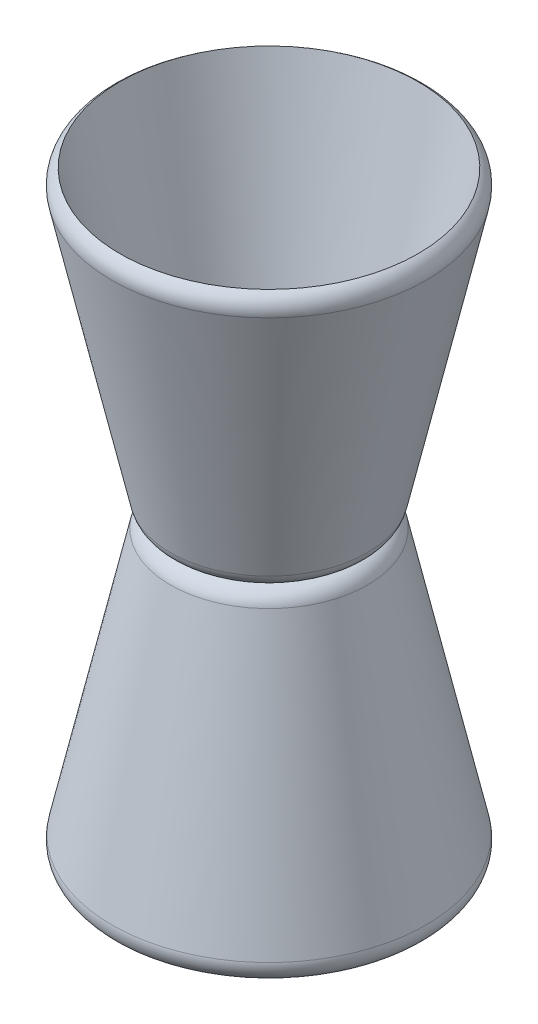
ISO-10303-21;
HEADER;
FILE_DESCRIPTION(('STEP AP214'),'2;1');
FILE_NAME('part.step','',(''),(''),'','','');
FILE_SCHEMA(('AUTOMOTIVE_DESIGN { 1 0 10303 214 1 1 1 1 }'));
ENDSEC;
DATA;
#1=APPLICATION_CONTEXT('core data for automotive mechanical design processes');
#2=APPLICATION_PROTOCOL_DEFINITION('international standard','automotive_design',2000,#1);
#3=PRODUCT_CONTEXT('',#1,'mechanical');
#4=PRODUCT('Part','Part','',(#3));
#5=PRODUCT_RELATED_PRODUCT_CATEGORY('part','',(#4));
#6=PRODUCT_DEFINITION_FORMATION('','',#4);
#7=PRODUCT_DEFINITION_CONTEXT('part definition',#1,'design');
#8=PRODUCT_DEFINITION('design','',#6,#7);
#9=PRODUCT_DEFINITION_SHAPE('','',#8);
#10=(LENGTH_UNIT() NAMED_UNIT(*) SI_UNIT(.MILLI.,.METRE.));
#11=(NAMED_UNIT(*) PLANE_ANGLE_UNIT() SI_UNIT($,.RADIAN.));
#12=(NAMED_UNIT(*) SI_UNIT($,.STERADIAN.) SOLID_ANGLE_UNIT());
#13=UNCERTAINTY_MEASURE_WITH_UNIT(LENGTH_MEASURE(1.E-05),#10,'distance_accuracy_value','');
#14=(GEOMETRIC_REPRESENTATION_CONTEXT(3) GLOBAL_UNCERTAINTY_ASSIGNED_CONTEXT((#13)) GLOBAL_UNIT_ASSIGNED_CONTEXT((#10,
#11,#12)) REPRESENTATION_CONTEXT('',''));
#15=CARTESIAN_POINT('',(0.,0.,0.));
#16=DIRECTION('',(0.,0.,1.));
#17=DIRECTION('',(1.,0.,0.));
#18=AXIS2_PLACEMENT_3D('',#15,#16,#17);
#19=CARTESIAN_POINT('',(0.,-330.841690925662,0.));
#20=DIRECTION('',(0.,-1.,0.));
#21=DIRECTION('',(1.,0.,0.));
#22=AXIS2_PLACEMENT_3D('',#19,#20,#21);
#23=PLANE('',#22);
#24=CARTESIAN_POINT('',(0.,-330.841690925662,0.));
#25=DIRECTION('',(0.,1.,0.));
#26=DIRECTION('',(-1.,0.,0.));
#27=AXIS2_PLACEMENT_3D('',#24,#25,#26);
#28=CIRCLE('',#27,150.565807481014);
#29=CARTESIAN_POINT('',(-150.565807481014,-330.841690925663,0.));
#30=VERTEX_POINT('',#29);
#31=EDGE_CURVE('E65',#30,#30,#28,.T.);
#32=ORIENTED_EDGE('',*,*,#31,.T.);
#33=EDGE_LOOP('',(#32));
#34=FACE_BOUND('',#33,.T.);
#35=ADVANCED_FACE('F37',(#34),#23,.F.);
#36=CARTESIAN_POINT('',(-1.37499654681077E-12,119.158309074338,0.));
#37=DIRECTION('',(0.,1.,0.));
#38=DIRECTION('',(-1.,0.,0.));
#39=AXIS2_PLACEMENT_3D('',#36,#37,#38);
#40=CONICAL_SURFACE('',#39,250.000000000001,0.217470446784428);
#41=ORIENTED_EDGE('',*,*,#31,.F.);
#42=EDGE_LOOP('',(#41));
#43=FACE_BOUND('',#42,.T.);
#44=CARTESIAN_POINT('',(-1.37499654681077E-12,119.158309074338,0.));
#45=DIRECTION('',(0.,1.,0.));
#46=DIRECTION('',(-1.,0.,0.));
#47=AXIS2_PLACEMENT_3D('',#44,#45,#46);
#48=CIRCLE('',#47,250.000000000001);
#49=CARTESIAN_POINT('',(-250.000000000003,119.158309074337,0.));
#50=VERTEX_POINT('',#49);
#51=EDGE_CURVE('E69',#50,#50,#48,.T.);
#52=ORIENTED_EDGE('',*,*,#51,.T.);
#53=EDGE_LOOP('',(#52));
#54=FACE_BOUND('',#53,.T.);
#55=ADVANCED_FACE('F100',(#43,#54),#40,.F.);
#56=CARTESIAN_POINT('',(1.4698612125882E-13,-380.841690925662,0.));
#57=DIRECTION('',(0.,1.,0.));
#58=DIRECTION('',(-1.,0.,0.));
#59=AXIS2_PLACEMENT_3D('',#56,#57,#58);
#60=CONICAL_SURFACE('',#59,160.,0.217470446784428);
#61=CARTESIAN_POINT('',(0.,-357.314501215556,0.));
#62=DIRECTION('',(0.,-1.,0.));
#63=DIRECTION('',(1.,0.,0.));
#64=AXIS2_PLACEMENT_3D('',#61,#62,#63);
#65=CIRCLE('',#64,165.198682469034);
#66=CARTESIAN_POINT('',(165.198682469034,-357.314501215556,0.));
#67=VERTEX_POINT('',#66);
#68=EDGE_CURVE('E55',#67,#67,#65,.F.);
#69=ORIENTED_EDGE('',*,*,#68,.T.);
#70=EDGE_LOOP('',(#69));
#71=FACE_BOUND('',#70,.T.);
#72=CARTESIAN_POINT('',(-1.27779274856509E-12,87.2250287929783,0.));
#73=DIRECTION('',(0.,-1.,0.));
#74=DIRECTION('',(1.,0.,0.));
#75=AXIS2_PLACEMENT_3D('',#72,#73,#74);
#76=CIRCLE('',#75,263.426302933854);
#77=CARTESIAN_POINT('',(263.426302933853,87.2250287929791,0.));
#78=VERTEX_POINT('',#77);
#79=EDGE_CURVE('E61',#78,#78,#76,.T.);
#80=ORIENTED_EDGE('',*,*,#79,.T.);
#81=EDGE_LOOP('',(#80));
#82=FACE_BOUND('',#81,.T.);
#83=ADVANCED_FACE('F106',(#71,#82),#60,.T.);
#84=CARTESIAN_POINT('',(0.,-350.841690925662,0.));
#85=DIRECTION('',(0.,1.,0.));
#86=DIRECTION('',(-1.,0.,0.));
#87=AXIS2_PLACEMENT_3D('',#84,#85,#86);
#88=TOROIDAL_SURFACE('',#87,135.905291969622,30.);
#89=CARTESIAN_POINT('',(1.46986121258819E-13,-380.841690925662,0.));
#90=DIRECTION('',(0.,1.,0.));
#91=DIRECTION('',(-1.,0.,0.));
#92=AXIS2_PLACEMENT_3D('',#89,#90,#91);
#93=CIRCLE('',#92,135.905291969622);
#94=CARTESIAN_POINT('',(-135.905291969622,-380.841690925662,0.));
#95=VERTEX_POINT('',#94);
#96=EDGE_CURVE('E50',#95,#95,#93,.F.);
#97=ORIENTED_EDGE('',*,*,#96,.F.);
#98=EDGE_LOOP('',(#97));
#99=FACE_BOUND('',#98,.T.);
#100=ORIENTED_EDGE('',*,*,#68,.F.);
#101=EDGE_LOOP('',(#100));
#102=FACE_BOUND('',#101,.T.);
#103=ADVANCED_FACE('F111',(#99,#102),#88,.T.);
#104=CARTESIAN_POINT('',(-1.29749575871494E-12,93.6978390828725,0.));
#105=DIRECTION('',(0.,1.,0.));
#106=DIRECTION('',(-1.,0.,0.));
#107=AXIS2_PLACEMENT_3D('',#104,#105,#106);
#108=TOROIDAL_SURFACE('',#107,234.132912434442,30.);
#109=ORIENTED_EDGE('',*,*,#79,.F.);
#110=EDGE_LOOP('',(#109));
#111=FACE_BOUND('',#110,.T.);
#112=ORIENTED_EDGE('',*,*,#51,.F.);
#113=EDGE_LOOP('',(#112));
#114=FACE_BOUND('',#113,.T.);
#115=ADVANCED_FACE('F96',(#111,#114),#108,.T.);
#116=CARTESIAN_POINT('',(2.99184388065778E-13,-430.841690925662,0.));
#117=DIRECTION('',(0.,1.,0.));
#118=DIRECTION('',(1.,0.,0.));
#119=AXIS2_PLACEMENT_3D('',#116,#117,#118);
#120=PLANE('',#119);
#121=CARTESIAN_POINT('',(2.99184388065777E-13,-430.841690925662,0.));
#122=DIRECTION('',(0.,1.,0.));
#123=DIRECTION('',(-1.,0.,0.));
#124=AXIS2_PLACEMENT_3D('',#121,#122,#123);
#125=CIRCLE('',#124,150.565807481014);
#126=CARTESIAN_POINT('',(-150.565807481014,-430.841690925662,0.));
#127=VERTEX_POINT('',#126);
#128=EDGE_CURVE('E73',#127,#127,#125,.T.);
#129=ORIENTED_EDGE('',*,*,#128,.F.);
#130=EDGE_LOOP('',(#129));
#131=FACE_BOUND('',#130,.T.);
#132=ADVANCED_FACE('F87',(#131),#120,.F.);
#133=CARTESIAN_POINT('',(1.66896878932841E-12,-880.841690925661,0.));
#134=DIRECTION('',(0.,-1.,0.));
#135=DIRECTION('',(-1.,0.,0.));
#136=AXIS2_PLACEMENT_3D('',#133,#134,#135);
#137=CONICAL_SURFACE('',#136,250.000000000001,0.217470446784428);
#138=ORIENTED_EDGE('',*,*,#128,.T.);
#139=EDGE_LOOP('',(#138));
#140=FACE_BOUND('',#139,.T.);
#141=CARTESIAN_POINT('',(1.66896878932841E-12,-880.841690925661,0.));
#142=DIRECTION('',(0.,1.,0.));
#143=DIRECTION('',(-1.,0.,0.));
#144=AXIS2_PLACEMENT_3D('',#141,#142,#143);
#145=CIRCLE('',#144,250.000000000001);
#146=CARTESIAN_POINT('',(-250.,-880.841690925662,0.));
#147=VERTEX_POINT('',#146);
#148=EDGE_CURVE('E77',#147,#147,#145,.T.);
#149=ORIENTED_EDGE('',*,*,#148,.F.);
#150=EDGE_LOOP('',(#149));
#151=FACE_BOUND('',#150,.T.);
#152=ADVANCED_FACE('F84',(#140,#151),#137,.F.);
#153=CARTESIAN_POINT('',(1.46986121258818E-13,-380.841690925662,0.));
#154=DIRECTION('',(0.,-1.,0.));
#155=DIRECTION('',(-1.,0.,0.));
#156=AXIS2_PLACEMENT_3D('',#153,#154,#155);
#157=CONICAL_SURFACE('',#156,160.,0.217470446784428);
#158=CARTESIAN_POINT('',(2.18602071193151E-13,-404.368880635768,0.));
#159=DIRECTION('',(0.,1.,0.));
#160=DIRECTION('',(-1.,0.,0.));
#161=AXIS2_PLACEMENT_3D('',#158,#159,#160);
#162=CIRCLE('',#161,165.198682469034);
#163=CARTESIAN_POINT('',(-165.198682469034,-404.368880635768,0.));
#164=VERTEX_POINT('',#163);
#165=EDGE_CURVE('E10',#164,#164,#162,.F.);
#166=ORIENTED_EDGE('',*,*,#165,.T.);
#167=EDGE_LOOP('',(#166));
#168=FACE_BOUND('',#167,.T.);
#169=CARTESIAN_POINT('',(1.57176499108271E-12,-848.908410644294,0.));
#170=DIRECTION('',(0.,1.,0.));
#171=DIRECTION('',(-1.,0.,0.));
#172=AXIS2_PLACEMENT_3D('',#169,#170,#171);
#173=CIRCLE('',#172,263.426302933852);
#174=CARTESIAN_POINT('',(-263.42630293385,-848.908410644295,0.));
#175=VERTEX_POINT('',#174);
#176=EDGE_CURVE('E45',#175,#175,#173,.T.);
#177=ORIENTED_EDGE('',*,*,#176,.T.);
#178=EDGE_LOOP('',(#177));
#179=FACE_BOUND('',#178,.T.);
#180=ADVANCED_FACE('F86',(#168,#179),#157,.T.);
#181=CARTESIAN_POINT('',(2.38305081342994E-13,-410.841690925662,0.));
#182=DIRECTION('',(0.,-1.,0.));
#183=DIRECTION('',(1.,0.,0.));
#184=AXIS2_PLACEMENT_3D('',#181,#182,#183);
#185=TOROIDAL_SURFACE('',#184,135.905291969622,30.);
#186=ORIENTED_EDGE('',*,*,#165,.F.);
#187=EDGE_LOOP('',(#186));
#188=FACE_BOUND('',#187,.T.);
#189=ORIENTED_EDGE('',*,*,#96,.T.);
#190=EDGE_LOOP('',(#189));
#191=FACE_BOUND('',#190,.T.);
#192=ADVANCED_FACE('F94',(#188,#191),#185,.T.);
#193=CARTESIAN_POINT('',(1.59146800123255E-12,-855.381220934189,0.));
#194=DIRECTION('',(0.,-1.,0.));
#195=DIRECTION('',(1.,0.,0.));
#196=AXIS2_PLACEMENT_3D('',#193,#194,#195);
#197=TOROIDAL_SURFACE('',#196,234.13291243444,30.);
#198=ORIENTED_EDGE('',*,*,#148,.T.);
#199=EDGE_LOOP('',(#198));
#200=FACE_BOUND('',#199,.T.);
#201=ORIENTED_EDGE('',*,*,#176,.F.);
#202=EDGE_LOOP('',(#201));
#203=FACE_BOUND('',#202,.T.);
#204=ADVANCED_FACE('F39',(#200,#203),#197,.T.);
#205=CLOSED_SHELL('',(#35,#55,#83,#103,#115,#132,#152,#180,#192,#204));
#206=MANIFOLD_SOLID_BREP('B2',#205);
#207=ADVANCED_BREP_SHAPE_REPRESENTATION('',(#18,#206),#14);
#208=SHAPE_DEFINITION_REPRESENTATION(#9,#207);
ENDSEC;
END-ISO-10303-21;
